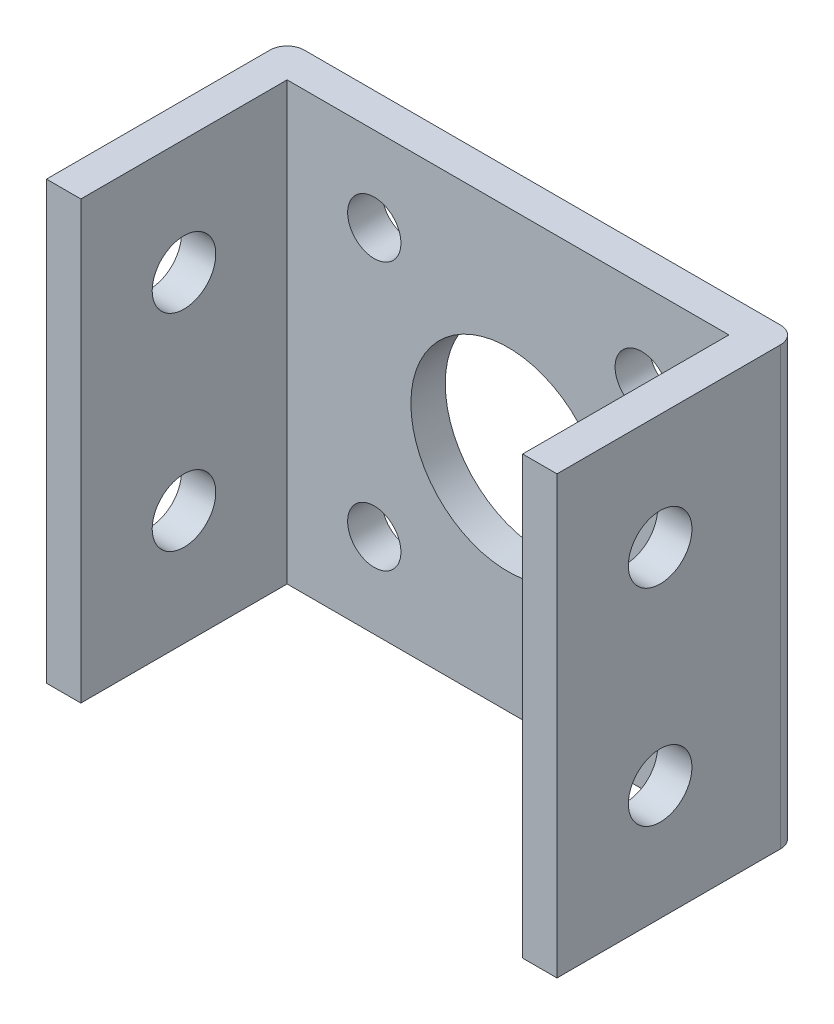
ISO-10303-21;
HEADER;
FILE_DESCRIPTION(('STEP AP214'),'2;1');
FILE_NAME('part.step','',(''),(''),'','','');
FILE_SCHEMA(('AUTOMOTIVE_DESIGN { 1 0 10303 214 1 1 1 1 }'));
ENDSEC;
DATA;
#1=APPLICATION_CONTEXT('core data for automotive mechanical design processes');
#2=APPLICATION_PROTOCOL_DEFINITION('international standard','automotive_design',2000,#1);
#3=PRODUCT_CONTEXT('',#1,'mechanical');
#4=PRODUCT('Part','Part','',(#3));
#5=PRODUCT_RELATED_PRODUCT_CATEGORY('part','',(#4));
#6=PRODUCT_DEFINITION_FORMATION('','',#4);
#7=PRODUCT_DEFINITION_CONTEXT('part definition',#1,'design');
#8=PRODUCT_DEFINITION('design','',#6,#7);
#9=PRODUCT_DEFINITION_SHAPE('','',#8);
#10=(LENGTH_UNIT() NAMED_UNIT(*) SI_UNIT(.MILLI.,.METRE.));
#11=(NAMED_UNIT(*) PLANE_ANGLE_UNIT() SI_UNIT($,.RADIAN.));
#12=(NAMED_UNIT(*) SI_UNIT($,.STERADIAN.) SOLID_ANGLE_UNIT());
#13=UNCERTAINTY_MEASURE_WITH_UNIT(LENGTH_MEASURE(1.E-05),#10,'distance_accuracy_value','');
#14=(GEOMETRIC_REPRESENTATION_CONTEXT(3) GLOBAL_UNCERTAINTY_ASSIGNED_CONTEXT((#13)) GLOBAL_UNIT_ASSIGNED_CONTEXT((#10,
#11,#12)) REPRESENTATION_CONTEXT('',''));
#15=CARTESIAN_POINT('',(0.,0.,0.));
#16=DIRECTION('',(0.,0.,1.));
#17=DIRECTION('',(1.,0.,0.));
#18=AXIS2_PLACEMENT_3D('',#15,#16,#17);
#19=CARTESIAN_POINT('',(-14.85,12.7,14.));
#20=DIRECTION('',(1.,0.,0.));
#21=DIRECTION('',(0.,0.,-1.));
#22=AXIS2_PLACEMENT_3D('',#19,#20,#21);
#23=PLANE('',#22);
#24=CARTESIAN_POINT('',(-14.85,6.,8.));
#25=DIRECTION('',(-1.,0.,0.));
#26=DIRECTION('',(0.,0.,1.));
#27=AXIS2_PLACEMENT_3D('',#24,#25,#26);
#28=CIRCLE('',#27,1.85);
#29=CARTESIAN_POINT('',(-14.85,6.,9.85));
#30=VERTEX_POINT('',#29);
#31=EDGE_CURVE('E228',#30,#30,#28,.T.);
#32=ORIENTED_EDGE('',*,*,#31,.F.);
#33=EDGE_LOOP('',(#32));
#34=FACE_BOUND('',#33,.T.);
#35=CARTESIAN_POINT('',(-14.85,-6.,8.));
#36=DIRECTION('',(-1.,0.,0.));
#37=DIRECTION('',(0.,0.,1.));
#38=AXIS2_PLACEMENT_3D('',#35,#36,#37);
#39=CIRCLE('',#38,1.85);
#40=CARTESIAN_POINT('',(-14.85,-6.,9.85));
#41=VERTEX_POINT('',#40);
#42=EDGE_CURVE('E216',#41,#41,#39,.T.);
#43=ORIENTED_EDGE('',*,*,#42,.F.);
#44=EDGE_LOOP('',(#43));
#45=FACE_BOUND('',#44,.T.);
#46=DIRECTION('',(0.,0.,1.));
#47=VECTOR('',#46,1.);
#48=CARTESIAN_POINT('',(-14.85,12.7,14.));
#49=LINE('',#48,#47);
#50=CARTESIAN_POINT('',(-14.85,12.7,0.999999999999999));
#51=VERTEX_POINT('',#50);
#52=CARTESIAN_POINT('',(-14.85,12.7,14.));
#53=VERTEX_POINT('',#52);
#54=EDGE_CURVE('E111',#51,#53,#49,.T.);
#55=ORIENTED_EDGE('',*,*,#54,.F.);
#56=DIRECTION('',(0.,-1.,0.));
#57=VECTOR('',#56,1.);
#58=CARTESIAN_POINT('',(-14.85,12.7,0.999999999999999));
#59=LINE('',#58,#57);
#60=CARTESIAN_POINT('',(-14.85,-12.7,0.999999999999999));
#61=VERTEX_POINT('',#60);
#62=EDGE_CURVE('E11',#51,#61,#59,.T.);
#63=ORIENTED_EDGE('',*,*,#62,.T.);
#64=DIRECTION('',(0.,0.,1.));
#65=VECTOR('',#64,1.);
#66=CARTESIAN_POINT('',(-14.85,-12.7,14.));
#67=LINE('',#66,#65);
#68=CARTESIAN_POINT('',(-14.85,-12.7,14.));
#69=VERTEX_POINT('',#68);
#70=EDGE_CURVE('E131',#61,#69,#67,.T.);
#71=ORIENTED_EDGE('',*,*,#70,.T.);
#72=DIRECTION('',(0.,-1.,0.));
#73=VECTOR('',#72,1.);
#74=CARTESIAN_POINT('',(-14.85,12.7,14.));
#75=LINE('',#74,#73);
#76=EDGE_CURVE('E124',#53,#69,#75,.T.);
#77=ORIENTED_EDGE('',*,*,#76,.F.);
#78=EDGE_LOOP('',(#55,#63,#71,#77));
#79=FACE_BOUND('',#78,.T.);
#80=ADVANCED_FACE('F34',(#34,#45,#79),#23,.F.);
#81=CARTESIAN_POINT('',(-12.85,12.7,14.));
#82=DIRECTION('',(0.,0.,-1.));
#83=DIRECTION('',(-1.,0.,0.));
#84=AXIS2_PLACEMENT_3D('',#81,#82,#83);
#85=PLANE('',#84);
#86=DIRECTION('',(1.,0.,0.));
#87=VECTOR('',#86,1.);
#88=CARTESIAN_POINT('',(-12.85,-12.7,14.));
#89=LINE('',#88,#87);
#90=CARTESIAN_POINT('',(-12.85,-12.7,14.));
#91=VERTEX_POINT('',#90);
#92=EDGE_CURVE('E197',#69,#91,#89,.T.);
#93=ORIENTED_EDGE('',*,*,#92,.T.);
#94=DIRECTION('',(0.,-1.,0.));
#95=VECTOR('',#94,1.);
#96=CARTESIAN_POINT('',(-12.85,12.7,14.));
#97=LINE('',#96,#95);
#98=CARTESIAN_POINT('',(-12.85,12.7,14.));
#99=VERTEX_POINT('',#98);
#100=EDGE_CURVE('E126',#99,#91,#97,.T.);
#101=ORIENTED_EDGE('',*,*,#100,.F.);
#102=DIRECTION('',(1.,0.,0.));
#103=VECTOR('',#102,1.);
#104=CARTESIAN_POINT('',(-12.85,12.7,14.));
#105=LINE('',#104,#103);
#106=EDGE_CURVE('E114',#53,#99,#105,.T.);
#107=ORIENTED_EDGE('',*,*,#106,.F.);
#108=ORIENTED_EDGE('',*,*,#76,.T.);
#109=EDGE_LOOP('',(#93,#101,#107,#108));
#110=FACE_BOUND('',#109,.T.);
#111=ADVANCED_FACE('F123',(#110),#85,.F.);
#112=CARTESIAN_POINT('',(-12.85,12.7,2.));
#113=DIRECTION('',(-1.,0.,0.));
#114=DIRECTION('',(0.,0.,1.));
#115=AXIS2_PLACEMENT_3D('',#112,#113,#114);
#116=PLANE('',#115);
#117=CARTESIAN_POINT('',(-12.85,6.,8.));
#118=DIRECTION('',(-1.,0.,0.));
#119=DIRECTION('',(0.,0.,1.));
#120=AXIS2_PLACEMENT_3D('',#117,#118,#119);
#121=CIRCLE('',#120,1.85);
#122=CARTESIAN_POINT('',(-12.85,6.,9.85));
#123=VERTEX_POINT('',#122);
#124=EDGE_CURVE('E219',#123,#123,#121,.T.);
#125=ORIENTED_EDGE('',*,*,#124,.T.);
#126=EDGE_LOOP('',(#125));
#127=FACE_BOUND('',#126,.T.);
#128=CARTESIAN_POINT('',(-12.85,-6.,8.));
#129=DIRECTION('',(-1.,0.,0.));
#130=DIRECTION('',(0.,0.,1.));
#131=AXIS2_PLACEMENT_3D('',#128,#129,#130);
#132=CIRCLE('',#131,1.85);
#133=CARTESIAN_POINT('',(-12.85,-6.,9.85));
#134=VERTEX_POINT('',#133);
#135=EDGE_CURVE('E201',#134,#134,#132,.T.);
#136=ORIENTED_EDGE('',*,*,#135,.T.);
#137=EDGE_LOOP('',(#136));
#138=FACE_BOUND('',#137,.T.);
#139=DIRECTION('',(0.,0.,-1.));
#140=VECTOR('',#139,1.);
#141=CARTESIAN_POINT('',(-12.85,-12.7,2.));
#142=LINE('',#141,#140);
#143=CARTESIAN_POINT('',(-12.85,-12.7,2.));
#144=VERTEX_POINT('',#143);
#145=EDGE_CURVE('E195',#91,#144,#142,.T.);
#146=ORIENTED_EDGE('',*,*,#145,.T.);
#147=DIRECTION('',(0.,-1.,0.));
#148=VECTOR('',#147,1.);
#149=CARTESIAN_POINT('',(-12.85,12.7,2.));
#150=LINE('',#149,#148);
#151=CARTESIAN_POINT('',(-12.85,12.7,2.));
#152=VERTEX_POINT('',#151);
#153=EDGE_CURVE('E137',#152,#144,#150,.T.);
#154=ORIENTED_EDGE('',*,*,#153,.F.);
#155=DIRECTION('',(0.,0.,-1.));
#156=VECTOR('',#155,1.);
#157=CARTESIAN_POINT('',(-12.85,12.7,2.));
#158=LINE('',#157,#156);
#159=EDGE_CURVE('E128',#99,#152,#158,.T.);
#160=ORIENTED_EDGE('',*,*,#159,.F.);
#161=ORIENTED_EDGE('',*,*,#100,.T.);
#162=EDGE_LOOP('',(#146,#154,#160,#161));
#163=FACE_BOUND('',#162,.T.);
#164=ADVANCED_FACE('F276',(#127,#138,#163),#116,.F.);
#165=CARTESIAN_POINT('',(12.85,12.7,2.00000000000001));
#166=DIRECTION('',(0.,0.,-1.));
#167=DIRECTION('',(-1.,0.,0.));
#168=AXIS2_PLACEMENT_3D('',#165,#166,#167);
#169=PLANE('',#168);
#170=CARTESIAN_POINT('',(7.78,7.78,2.00000000000001));
#171=DIRECTION('',(0.,0.,1.));
#172=DIRECTION('',(1.,0.,0.));
#173=AXIS2_PLACEMENT_3D('',#170,#171,#172);
#174=CIRCLE('',#173,1.55);
#175=CARTESIAN_POINT('',(9.33,7.78,2.00000000000001));
#176=VERTEX_POINT('',#175);
#177=EDGE_CURVE('E258',#176,#176,#174,.T.);
#178=ORIENTED_EDGE('',*,*,#177,.F.);
#179=EDGE_LOOP('',(#178));
#180=FACE_BOUND('',#179,.T.);
#181=CARTESIAN_POINT('',(7.78,-7.78,2.00000000000001));
#182=DIRECTION('',(0.,0.,1.));
#183=DIRECTION('',(1.,0.,0.));
#184=AXIS2_PLACEMENT_3D('',#181,#182,#183);
#185=CIRCLE('',#184,1.55);
#186=CARTESIAN_POINT('',(9.33,-7.78,2.00000000000001));
#187=VERTEX_POINT('',#186);
#188=EDGE_CURVE('E252',#187,#187,#185,.T.);
#189=ORIENTED_EDGE('',*,*,#188,.F.);
#190=EDGE_LOOP('',(#189));
#191=FACE_BOUND('',#190,.T.);
#192=CARTESIAN_POINT('',(-7.78,-7.78,2.00000000000001));
#193=DIRECTION('',(0.,0.,1.));
#194=DIRECTION('',(1.,0.,0.));
#195=AXIS2_PLACEMENT_3D('',#192,#193,#194);
#196=CIRCLE('',#195,1.55);
#197=CARTESIAN_POINT('',(-6.23,-7.78,2.00000000000001));
#198=VERTEX_POINT('',#197);
#199=EDGE_CURVE('E246',#198,#198,#196,.T.);
#200=ORIENTED_EDGE('',*,*,#199,.F.);
#201=EDGE_LOOP('',(#200));
#202=FACE_BOUND('',#201,.T.);
#203=CARTESIAN_POINT('',(-7.78,7.78,2.00000000000001));
#204=DIRECTION('',(0.,0.,1.));
#205=DIRECTION('',(1.,0.,0.));
#206=AXIS2_PLACEMENT_3D('',#203,#204,#205);
#207=CIRCLE('',#206,1.55);
#208=CARTESIAN_POINT('',(-6.23,7.78,2.00000000000001));
#209=VERTEX_POINT('',#208);
#210=EDGE_CURVE('E240',#209,#209,#207,.T.);
#211=ORIENTED_EDGE('',*,*,#210,.F.);
#212=EDGE_LOOP('',(#211));
#213=FACE_BOUND('',#212,.T.);
#214=CARTESIAN_POINT('',(0.,0.,2.00000000000001));
#215=DIRECTION('',(0.,0.,-1.));
#216=DIRECTION('',(-1.,0.,0.));
#217=AXIS2_PLACEMENT_3D('',#214,#215,#216);
#218=CIRCLE('',#217,5.65);
#219=CARTESIAN_POINT('',(-5.65,0.,2.00000000000001));
#220=VERTEX_POINT('',#219);
#221=EDGE_CURVE('E231',#220,#220,#218,.T.);
#222=ORIENTED_EDGE('',*,*,#221,.T.);
#223=EDGE_LOOP('',(#222));
#224=FACE_BOUND('',#223,.T.);
#225=DIRECTION('',(1.,0.,0.));
#226=VECTOR('',#225,1.);
#227=CARTESIAN_POINT('',(12.85,-12.7,2.00000000000001));
#228=LINE('',#227,#226);
#229=CARTESIAN_POINT('',(12.85,-12.7,2.00000000000001));
#230=VERTEX_POINT('',#229);
#231=EDGE_CURVE('E190',#144,#230,#228,.T.);
#232=ORIENTED_EDGE('',*,*,#231,.T.);
#233=DIRECTION('',(0.,-1.,0.));
#234=VECTOR('',#233,1.);
#235=CARTESIAN_POINT('',(12.85,12.7,2.00000000000001));
#236=LINE('',#235,#234);
#237=CARTESIAN_POINT('',(12.85,12.7,2.00000000000001));
#238=VERTEX_POINT('',#237);
#239=EDGE_CURVE('E181',#238,#230,#236,.T.);
#240=ORIENTED_EDGE('',*,*,#239,.F.);
#241=DIRECTION('',(1.,0.,0.));
#242=VECTOR('',#241,1.);
#243=CARTESIAN_POINT('',(12.85,12.7,2.00000000000001));
#244=LINE('',#243,#242);
#245=EDGE_CURVE('E191',#152,#238,#244,.T.);
#246=ORIENTED_EDGE('',*,*,#245,.F.);
#247=ORIENTED_EDGE('',*,*,#153,.T.);
#248=EDGE_LOOP('',(#232,#240,#246,#247));
#249=FACE_BOUND('',#248,.T.);
#250=ADVANCED_FACE('F188',(#180,#191,#202,#213,#224,#249),#169,.F.);
#251=CARTESIAN_POINT('',(12.85,12.7,14.));
#252=DIRECTION('',(1.,0.,0.));
#253=DIRECTION('',(0.,0.,-1.));
#254=AXIS2_PLACEMENT_3D('',#251,#252,#253);
#255=PLANE('',#254);
#256=CARTESIAN_POINT('',(12.85,6.,8.));
#257=DIRECTION('',(1.,0.,0.));
#258=DIRECTION('',(0.,0.,-1.));
#259=AXIS2_PLACEMENT_3D('',#256,#257,#258);
#260=CIRCLE('',#259,1.85);
#261=CARTESIAN_POINT('',(12.85,6.,6.15));
#262=VERTEX_POINT('',#261);
#263=EDGE_CURVE('E224',#262,#262,#260,.T.);
#264=ORIENTED_EDGE('',*,*,#263,.T.);
#265=EDGE_LOOP('',(#264));
#266=FACE_BOUND('',#265,.T.);
#267=CARTESIAN_POINT('',(12.85,-6.,8.));
#268=DIRECTION('',(1.,0.,0.));
#269=DIRECTION('',(0.,0.,-1.));
#270=AXIS2_PLACEMENT_3D('',#267,#268,#269);
#271=CIRCLE('',#270,1.85);
#272=CARTESIAN_POINT('',(12.85,-6.,6.15));
#273=VERTEX_POINT('',#272);
#274=EDGE_CURVE('E212',#273,#273,#271,.T.);
#275=ORIENTED_EDGE('',*,*,#274,.T.);
#276=EDGE_LOOP('',(#275));
#277=FACE_BOUND('',#276,.T.);
#278=DIRECTION('',(0.,0.,1.));
#279=VECTOR('',#278,1.);
#280=CARTESIAN_POINT('',(12.85,-12.7,14.));
#281=LINE('',#280,#279);
#282=CARTESIAN_POINT('',(12.85,-12.7,14.));
#283=VERTEX_POINT('',#282);
#284=EDGE_CURVE('E173',#230,#283,#281,.T.);
#285=ORIENTED_EDGE('',*,*,#284,.T.);
#286=DIRECTION('',(0.,-1.,0.));
#287=VECTOR('',#286,1.);
#288=CARTESIAN_POINT('',(12.85,12.7,14.));
#289=LINE('',#288,#287);
#290=CARTESIAN_POINT('',(12.85,12.7,14.));
#291=VERTEX_POINT('',#290);
#292=EDGE_CURVE('E178',#291,#283,#289,.T.);
#293=ORIENTED_EDGE('',*,*,#292,.F.);
#294=DIRECTION('',(0.,0.,1.));
#295=VECTOR('',#294,1.);
#296=CARTESIAN_POINT('',(12.85,12.7,14.));
#297=LINE('',#296,#295);
#298=EDGE_CURVE('E206',#238,#291,#297,.T.);
#299=ORIENTED_EDGE('',*,*,#298,.F.);
#300=ORIENTED_EDGE('',*,*,#239,.T.);
#301=EDGE_LOOP('',(#285,#293,#299,#300));
#302=FACE_BOUND('',#301,.T.);
#303=ADVANCED_FACE('F275',(#266,#277,#302),#255,.F.);
#304=CARTESIAN_POINT('',(14.85,12.7,14.));
#305=DIRECTION('',(0.,0.,-1.));
#306=DIRECTION('',(-1.,0.,0.));
#307=AXIS2_PLACEMENT_3D('',#304,#305,#306);
#308=PLANE('',#307);
#309=DIRECTION('',(1.,0.,0.));
#310=VECTOR('',#309,1.);
#311=CARTESIAN_POINT('',(14.85,-12.7,14.));
#312=LINE('',#311,#310);
#313=CARTESIAN_POINT('',(14.85,-12.7,14.));
#314=VERTEX_POINT('',#313);
#315=EDGE_CURVE('E170',#283,#314,#312,.T.);
#316=ORIENTED_EDGE('',*,*,#315,.T.);
#317=DIRECTION('',(0.,-1.,0.));
#318=VECTOR('',#317,1.);
#319=CARTESIAN_POINT('',(14.85,12.7,14.));
#320=LINE('',#319,#318);
#321=CARTESIAN_POINT('',(14.85,12.7,14.));
#322=VERTEX_POINT('',#321);
#323=EDGE_CURVE('E159',#322,#314,#320,.T.);
#324=ORIENTED_EDGE('',*,*,#323,.F.);
#325=DIRECTION('',(1.,0.,0.));
#326=VECTOR('',#325,1.);
#327=CARTESIAN_POINT('',(14.85,12.7,14.));
#328=LINE('',#327,#326);
#329=EDGE_CURVE('E204',#291,#322,#328,.T.);
#330=ORIENTED_EDGE('',*,*,#329,.F.);
#331=ORIENTED_EDGE('',*,*,#292,.T.);
#332=EDGE_LOOP('',(#316,#324,#330,#331));
#333=FACE_BOUND('',#332,.T.);
#334=ADVANCED_FACE('F324',(#333),#308,.F.);
#335=CARTESIAN_POINT('',(14.85,12.7,0.));
#336=DIRECTION('',(-1.,0.,0.));
#337=DIRECTION('',(0.,0.,1.));
#338=AXIS2_PLACEMENT_3D('',#335,#336,#337);
#339=PLANE('',#338);
#340=CARTESIAN_POINT('',(14.85,6.,8.));
#341=DIRECTION('',(-1.,0.,0.));
#342=DIRECTION('',(0.,0.,1.));
#343=AXIS2_PLACEMENT_3D('',#340,#341,#342);
#344=CIRCLE('',#343,1.85);
#345=CARTESIAN_POINT('',(14.85,6.,9.85));
#346=VERTEX_POINT('',#345);
#347=EDGE_CURVE('E227',#346,#346,#344,.T.);
#348=ORIENTED_EDGE('',*,*,#347,.T.);
#349=EDGE_LOOP('',(#348));
#350=FACE_BOUND('',#349,.T.);
#351=CARTESIAN_POINT('',(14.85,-6.,8.));
#352=DIRECTION('',(-1.,0.,0.));
#353=DIRECTION('',(0.,0.,1.));
#354=AXIS2_PLACEMENT_3D('',#351,#352,#353);
#355=CIRCLE('',#354,1.85);
#356=CARTESIAN_POINT('',(14.85,-6.,9.85));
#357=VERTEX_POINT('',#356);
#358=EDGE_CURVE('E215',#357,#357,#355,.T.);
#359=ORIENTED_EDGE('',*,*,#358,.T.);
#360=EDGE_LOOP('',(#359));
#361=FACE_BOUND('',#360,.T.);
#362=DIRECTION('',(0.,0.,-1.));
#363=VECTOR('',#362,1.);
#364=CARTESIAN_POINT('',(14.85,-12.7,0.));
#365=LINE('',#364,#363);
#366=CARTESIAN_POINT('',(14.85,-12.7,1.));
#367=VERTEX_POINT('',#366);
#368=EDGE_CURVE('E166',#314,#367,#365,.T.);
#369=ORIENTED_EDGE('',*,*,#368,.T.);
#370=DIRECTION('',(0.,-1.,0.));
#371=VECTOR('',#370,1.);
#372=CARTESIAN_POINT('',(14.85,12.7,1.));
#373=LINE('',#372,#371);
#374=CARTESIAN_POINT('',(14.85,12.7,1.));
#375=VERTEX_POINT('',#374);
#376=EDGE_CURVE('E57',#367,#375,#373,.F.);
#377=ORIENTED_EDGE('',*,*,#376,.T.);
#378=DIRECTION('',(0.,0.,-1.));
#379=VECTOR('',#378,1.);
#380=CARTESIAN_POINT('',(14.85,12.7,0.));
#381=LINE('',#380,#379);
#382=EDGE_CURVE('E151',#322,#375,#381,.T.);
#383=ORIENTED_EDGE('',*,*,#382,.F.);
#384=ORIENTED_EDGE('',*,*,#323,.T.);
#385=EDGE_LOOP('',(#369,#377,#383,#384));
#386=FACE_BOUND('',#385,.T.);
#387=ADVANCED_FACE('F168',(#350,#361,#386),#339,.F.);
#388=CARTESIAN_POINT('',(-14.85,12.7,0.));
#389=DIRECTION('',(0.,0.,1.));
#390=DIRECTION('',(1.,0.,0.));
#391=AXIS2_PLACEMENT_3D('',#388,#389,#390);
#392=PLANE('',#391);
#393=CARTESIAN_POINT('',(7.78,7.78,0.));
#394=DIRECTION('',(0.,0.,1.));
#395=DIRECTION('',(1.,0.,0.));
#396=AXIS2_PLACEMENT_3D('',#393,#394,#395);
#397=CIRCLE('',#396,1.55);
#398=CARTESIAN_POINT('',(9.33,7.78,0.));
#399=VERTEX_POINT('',#398);
#400=EDGE_CURVE('E255',#399,#399,#397,.T.);
#401=ORIENTED_EDGE('',*,*,#400,.T.);
#402=EDGE_LOOP('',(#401));
#403=FACE_BOUND('',#402,.T.);
#404=CARTESIAN_POINT('',(7.78,-7.78,0.));
#405=DIRECTION('',(0.,0.,1.));
#406=DIRECTION('',(1.,0.,0.));
#407=AXIS2_PLACEMENT_3D('',#404,#405,#406);
#408=CIRCLE('',#407,1.55);
#409=CARTESIAN_POINT('',(9.33,-7.78,0.));
#410=VERTEX_POINT('',#409);
#411=EDGE_CURVE('E249',#410,#410,#408,.T.);
#412=ORIENTED_EDGE('',*,*,#411,.T.);
#413=EDGE_LOOP('',(#412));
#414=FACE_BOUND('',#413,.T.);
#415=CARTESIAN_POINT('',(-7.78,-7.78,0.));
#416=DIRECTION('',(0.,0.,1.));
#417=DIRECTION('',(1.,0.,0.));
#418=AXIS2_PLACEMENT_3D('',#415,#416,#417);
#419=CIRCLE('',#418,1.55);
#420=CARTESIAN_POINT('',(-6.23,-7.78,0.));
#421=VERTEX_POINT('',#420);
#422=EDGE_CURVE('E243',#421,#421,#419,.T.);
#423=ORIENTED_EDGE('',*,*,#422,.T.);
#424=EDGE_LOOP('',(#423));
#425=FACE_BOUND('',#424,.T.);
#426=CARTESIAN_POINT('',(-7.78,7.78,0.));
#427=DIRECTION('',(0.,0.,1.));
#428=DIRECTION('',(1.,0.,0.));
#429=AXIS2_PLACEMENT_3D('',#426,#427,#428);
#430=CIRCLE('',#429,1.55);
#431=CARTESIAN_POINT('',(-6.23,7.78,0.));
#432=VERTEX_POINT('',#431);
#433=EDGE_CURVE('E239',#432,#432,#430,.T.);
#434=ORIENTED_EDGE('',*,*,#433,.T.);
#435=EDGE_LOOP('',(#434));
#436=FACE_BOUND('',#435,.T.);
#437=CARTESIAN_POINT('',(0.,0.,0.));
#438=DIRECTION('',(0.,0.,-1.));
#439=DIRECTION('',(-1.,0.,0.));
#440=AXIS2_PLACEMENT_3D('',#437,#438,#439);
#441=CIRCLE('',#440,5.65);
#442=CARTESIAN_POINT('',(-5.65,0.,0.));
#443=VERTEX_POINT('',#442);
#444=EDGE_CURVE('E236',#443,#443,#441,.T.);
#445=ORIENTED_EDGE('',*,*,#444,.F.);
#446=EDGE_LOOP('',(#445));
#447=FACE_BOUND('',#446,.T.);
#448=DIRECTION('',(-1.,0.,0.));
#449=VECTOR('',#448,1.);
#450=CARTESIAN_POINT('',(-14.85,12.7,0.));
#451=LINE('',#450,#449);
#452=CARTESIAN_POINT('',(13.85,12.7,0.));
#453=VERTEX_POINT('',#452);
#454=CARTESIAN_POINT('',(-13.85,12.7,0.));
#455=VERTEX_POINT('',#454);
#456=EDGE_CURVE('E150',#453,#455,#451,.T.);
#457=ORIENTED_EDGE('',*,*,#456,.F.);
#458=DIRECTION('',(0.,-1.,0.));
#459=VECTOR('',#458,1.);
#460=CARTESIAN_POINT('',(13.85,12.7,0.));
#461=LINE('',#460,#459);
#462=CARTESIAN_POINT('',(13.85,-12.7,0.));
#463=VERTEX_POINT('',#462);
#464=EDGE_CURVE('E135',#453,#463,#461,.T.);
#465=ORIENTED_EDGE('',*,*,#464,.T.);
#466=DIRECTION('',(-1.,0.,0.));
#467=VECTOR('',#466,1.);
#468=CARTESIAN_POINT('',(-14.85,-12.7,0.));
#469=LINE('',#468,#467);
#470=CARTESIAN_POINT('',(-13.85,-12.7,0.));
#471=VERTEX_POINT('',#470);
#472=EDGE_CURVE('E119',#463,#471,#469,.T.);
#473=ORIENTED_EDGE('',*,*,#472,.T.);
#474=DIRECTION('',(0.,-1.,0.));
#475=VECTOR('',#474,1.);
#476=CARTESIAN_POINT('',(-13.85,12.7,0.));
#477=LINE('',#476,#475);
#478=EDGE_CURVE('E133',#471,#455,#477,.F.);
#479=ORIENTED_EDGE('',*,*,#478,.T.);
#480=EDGE_LOOP('',(#457,#465,#473,#479));
#481=FACE_BOUND('',#480,.T.);
#482=ADVANCED_FACE('F155',(#403,#414,#425,#436,#447,#481),#392,.F.);
#483=CARTESIAN_POINT('',(0.,12.7,0.));
#484=DIRECTION('',(0.,-1.,0.));
#485=DIRECTION('',(0.,0.,-1.));
#486=AXIS2_PLACEMENT_3D('',#483,#484,#485);
#487=PLANE('',#486);
#488=ORIENTED_EDGE('',*,*,#382,.T.);
#489=CARTESIAN_POINT('',(13.85,12.7,1.));
#490=DIRECTION('',(0.,-1.,0.));
#491=DIRECTION('',(0.,0.,-1.));
#492=AXIS2_PLACEMENT_3D('',#489,#490,#491);
#493=CIRCLE('',#492,1.);
#494=EDGE_CURVE('E42',#375,#453,#493,.F.);
#495=ORIENTED_EDGE('',*,*,#494,.T.);
#496=ORIENTED_EDGE('',*,*,#456,.T.);
#497=CARTESIAN_POINT('',(-13.85,12.7,0.999999999999999));
#498=DIRECTION('',(0.,-1.,0.));
#499=DIRECTION('',(0.,0.,-1.));
#500=AXIS2_PLACEMENT_3D('',#497,#498,#499);
#501=CIRCLE('',#500,1.);
#502=EDGE_CURVE('E49',#455,#51,#501,.F.);
#503=ORIENTED_EDGE('',*,*,#502,.T.);
#504=ORIENTED_EDGE('',*,*,#54,.T.);
#505=ORIENTED_EDGE('',*,*,#106,.T.);
#506=ORIENTED_EDGE('',*,*,#159,.T.);
#507=ORIENTED_EDGE('',*,*,#245,.T.);
#508=ORIENTED_EDGE('',*,*,#298,.T.);
#509=ORIENTED_EDGE('',*,*,#329,.T.);
#510=EDGE_LOOP('',(#488,#495,#496,#503,#504,#505,#506,#507,#508,#509));
#511=FACE_BOUND('',#510,.T.);
#512=ADVANCED_FACE('F113',(#511),#487,.F.);
#513=CARTESIAN_POINT('',(0.,-12.7,0.));
#514=DIRECTION('',(0.,-1.,0.));
#515=DIRECTION('',(0.,0.,-1.));
#516=AXIS2_PLACEMENT_3D('',#513,#514,#515);
#517=PLANE('',#516);
#518=ORIENTED_EDGE('',*,*,#472,.F.);
#519=CARTESIAN_POINT('',(13.85,-12.7,1.));
#520=DIRECTION('',(0.,-1.,0.));
#521=DIRECTION('',(0.,0.,-1.));
#522=AXIS2_PLACEMENT_3D('',#519,#520,#521);
#523=CIRCLE('',#522,1.);
#524=EDGE_CURVE('E145',#463,#367,#523,.T.);
#525=ORIENTED_EDGE('',*,*,#524,.T.);
#526=ORIENTED_EDGE('',*,*,#368,.F.);
#527=ORIENTED_EDGE('',*,*,#315,.F.);
#528=ORIENTED_EDGE('',*,*,#284,.F.);
#529=ORIENTED_EDGE('',*,*,#231,.F.);
#530=ORIENTED_EDGE('',*,*,#145,.F.);
#531=ORIENTED_EDGE('',*,*,#92,.F.);
#532=ORIENTED_EDGE('',*,*,#70,.F.);
#533=CARTESIAN_POINT('',(-13.85,-12.7,0.999999999999999));
#534=DIRECTION('',(0.,-1.,0.));
#535=DIRECTION('',(0.,0.,-1.));
#536=AXIS2_PLACEMENT_3D('',#533,#534,#535);
#537=CIRCLE('',#536,1.);
#538=EDGE_CURVE('E143',#61,#471,#537,.T.);
#539=ORIENTED_EDGE('',*,*,#538,.T.);
#540=EDGE_LOOP('',(#518,#525,#526,#527,#528,#529,#530,#531,#532,#539));
#541=FACE_BOUND('',#540,.T.);
#542=ADVANCED_FACE('F164',(#541),#517,.T.);
#543=CARTESIAN_POINT('',(14.85,-6.,8.));
#544=DIRECTION('',(-1.,0.,0.));
#545=DIRECTION('',(0.,0.,1.));
#546=AXIS2_PLACEMENT_3D('',#543,#544,#545);
#547=CYLINDRICAL_SURFACE('',#546,1.85);
#548=ORIENTED_EDGE('',*,*,#358,.F.);
#549=EDGE_LOOP('',(#548));
#550=FACE_BOUND('',#549,.T.);
#551=ORIENTED_EDGE('',*,*,#274,.F.);
#552=EDGE_LOOP('',(#551));
#553=FACE_BOUND('',#552,.T.);
#554=ADVANCED_FACE('F346',(#550,#553),#547,.F.);
#555=ORIENTED_EDGE('',*,*,#42,.T.);
#556=EDGE_LOOP('',(#555));
#557=FACE_BOUND('',#556,.T.);
#558=ORIENTED_EDGE('',*,*,#135,.F.);
#559=EDGE_LOOP('',(#558));
#560=FACE_BOUND('',#559,.T.);
#561=ADVANCED_FACE('F344',(#557,#560),#547,.F.);
#562=CARTESIAN_POINT('',(14.85,6.,8.));
#563=DIRECTION('',(-1.,0.,0.));
#564=DIRECTION('',(0.,0.,1.));
#565=AXIS2_PLACEMENT_3D('',#562,#563,#564);
#566=CYLINDRICAL_SURFACE('',#565,1.85);
#567=ORIENTED_EDGE('',*,*,#347,.F.);
#568=EDGE_LOOP('',(#567));
#569=FACE_BOUND('',#568,.T.);
#570=ORIENTED_EDGE('',*,*,#263,.F.);
#571=EDGE_LOOP('',(#570));
#572=FACE_BOUND('',#571,.T.);
#573=ADVANCED_FACE('F299',(#569,#572),#566,.F.);
#574=ORIENTED_EDGE('',*,*,#31,.T.);
#575=EDGE_LOOP('',(#574));
#576=FACE_BOUND('',#575,.T.);
#577=ORIENTED_EDGE('',*,*,#124,.F.);
#578=EDGE_LOOP('',(#577));
#579=FACE_BOUND('',#578,.T.);
#580=ADVANCED_FACE('F289',(#576,#579),#566,.F.);
#581=CARTESIAN_POINT('',(0.,0.,14.));
#582=DIRECTION('',(0.,0.,-1.));
#583=DIRECTION('',(-1.,0.,0.));
#584=AXIS2_PLACEMENT_3D('',#581,#582,#583);
#585=CYLINDRICAL_SURFACE('',#584,5.65);
#586=ORIENTED_EDGE('',*,*,#444,.T.);
#587=EDGE_LOOP('',(#586));
#588=FACE_BOUND('',#587,.T.);
#589=ORIENTED_EDGE('',*,*,#221,.F.);
#590=EDGE_LOOP('',(#589));
#591=FACE_BOUND('',#590,.T.);
#592=ADVANCED_FACE('F286',(#588,#591),#585,.F.);
#593=CARTESIAN_POINT('',(-7.78,7.78,0.));
#594=DIRECTION('',(0.,0.,1.));
#595=DIRECTION('',(1.,0.,0.));
#596=AXIS2_PLACEMENT_3D('',#593,#594,#595);
#597=CYLINDRICAL_SURFACE('',#596,1.55);
#598=ORIENTED_EDGE('',*,*,#433,.F.);
#599=EDGE_LOOP('',(#598));
#600=FACE_BOUND('',#599,.T.);
#601=ORIENTED_EDGE('',*,*,#210,.T.);
#602=EDGE_LOOP('',(#601));
#603=FACE_BOUND('',#602,.T.);
#604=ADVANCED_FACE('F288',(#600,#603),#597,.F.);
#605=CARTESIAN_POINT('',(-7.78,-7.78,0.));
#606=DIRECTION('',(0.,0.,1.));
#607=DIRECTION('',(1.,0.,0.));
#608=AXIS2_PLACEMENT_3D('',#605,#606,#607);
#609=CYLINDRICAL_SURFACE('',#608,1.55);
#610=ORIENTED_EDGE('',*,*,#422,.F.);
#611=EDGE_LOOP('',(#610));
#612=FACE_BOUND('',#611,.T.);
#613=ORIENTED_EDGE('',*,*,#199,.T.);
#614=EDGE_LOOP('',(#613));
#615=FACE_BOUND('',#614,.T.);
#616=ADVANCED_FACE('F296',(#612,#615),#609,.F.);
#617=CARTESIAN_POINT('',(7.78,-7.78,0.));
#618=DIRECTION('',(0.,0.,1.));
#619=DIRECTION('',(1.,0.,0.));
#620=AXIS2_PLACEMENT_3D('',#617,#618,#619);
#621=CYLINDRICAL_SURFACE('',#620,1.55);
#622=ORIENTED_EDGE('',*,*,#411,.F.);
#623=EDGE_LOOP('',(#622));
#624=FACE_BOUND('',#623,.T.);
#625=ORIENTED_EDGE('',*,*,#188,.T.);
#626=EDGE_LOOP('',(#625));
#627=FACE_BOUND('',#626,.T.);
#628=ADVANCED_FACE('F269',(#624,#627),#621,.F.);
#629=CARTESIAN_POINT('',(7.78,7.78,0.));
#630=DIRECTION('',(0.,0.,1.));
#631=DIRECTION('',(1.,0.,0.));
#632=AXIS2_PLACEMENT_3D('',#629,#630,#631);
#633=CYLINDRICAL_SURFACE('',#632,1.55);
#634=ORIENTED_EDGE('',*,*,#400,.F.);
#635=EDGE_LOOP('',(#634));
#636=FACE_BOUND('',#635,.T.);
#637=ORIENTED_EDGE('',*,*,#177,.T.);
#638=EDGE_LOOP('',(#637));
#639=FACE_BOUND('',#638,.T.);
#640=ADVANCED_FACE('F266',(#636,#639),#633,.F.);
#641=CARTESIAN_POINT('',(13.85,12.7,1.));
#642=DIRECTION('',(0.,-1.,0.));
#643=DIRECTION('',(0.,0.,-1.));
#644=AXIS2_PLACEMENT_3D('',#641,#642,#643);
#645=CYLINDRICAL_SURFACE('',#644,1.);
#646=ORIENTED_EDGE('',*,*,#494,.F.);
#647=ORIENTED_EDGE('',*,*,#376,.F.);
#648=ORIENTED_EDGE('',*,*,#524,.F.);
#649=ORIENTED_EDGE('',*,*,#464,.F.);
#650=EDGE_LOOP('',(#646,#647,#648,#649));
#651=FACE_BOUND('',#650,.T.);
#652=ADVANCED_FACE('F161',(#651),#645,.T.);
#653=CARTESIAN_POINT('',(-13.85,12.7,0.999999999999999));
#654=DIRECTION('',(0.,-1.,0.));
#655=DIRECTION('',(0.,0.,-1.));
#656=AXIS2_PLACEMENT_3D('',#653,#654,#655);
#657=CYLINDRICAL_SURFACE('',#656,1.);
#658=ORIENTED_EDGE('',*,*,#502,.F.);
#659=ORIENTED_EDGE('',*,*,#478,.F.);
#660=ORIENTED_EDGE('',*,*,#538,.F.);
#661=ORIENTED_EDGE('',*,*,#62,.F.);
#662=EDGE_LOOP('',(#658,#659,#660,#661));
#663=FACE_BOUND('',#662,.T.);
#664=ADVANCED_FACE('F36',(#663),#657,.T.);
#665=CLOSED_SHELL('',(#80,#111,#164,#250,#303,#334,#387,#482,#512,#542,#554,#561,#573,#580,#592,
#604,#616,#628,#640,#652,#664));
#666=MANIFOLD_SOLID_BREP('B2',#665);
#667=ADVANCED_BREP_SHAPE_REPRESENTATION('',(#18,#666),#14);
#668=SHAPE_DEFINITION_REPRESENTATION(#9,#667);
ENDSEC;
END-ISO-10303-21;
